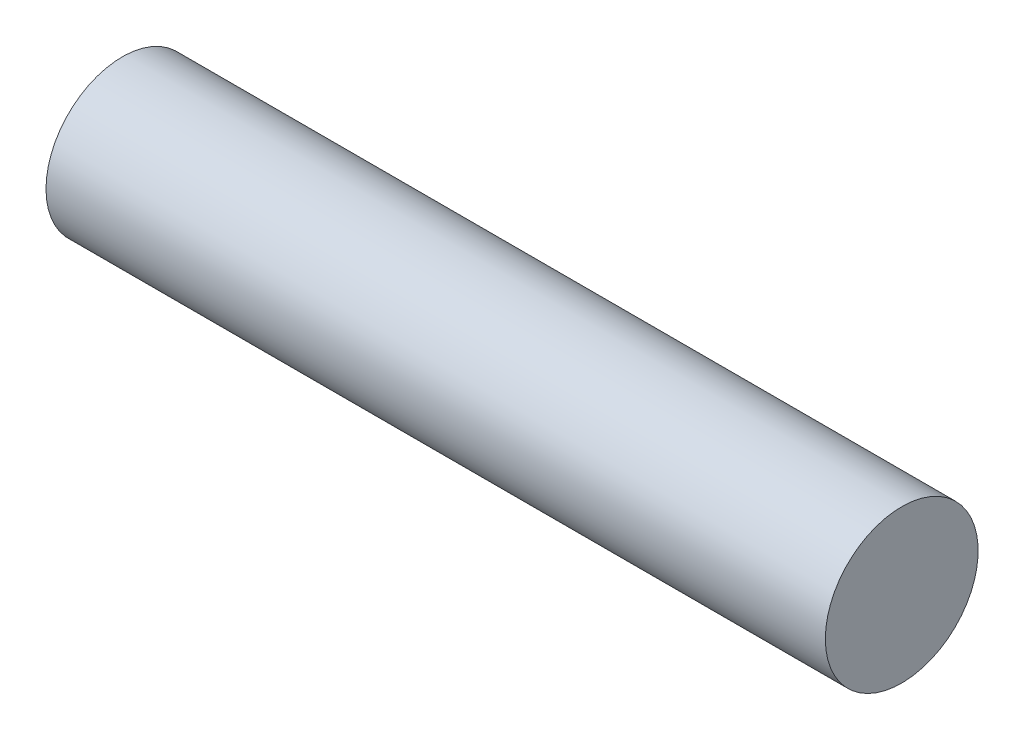
ISO-10303-21;
HEADER;
FILE_DESCRIPTION(('STEP AP214'),'2;1');
FILE_NAME('part.step','',(''),(''),'','','');
FILE_SCHEMA(('AUTOMOTIVE_DESIGN { 1 0 10303 214 1 1 1 1 }'));
ENDSEC;
DATA;
#1=APPLICATION_CONTEXT('core data for automotive mechanical design processes');
#2=APPLICATION_PROTOCOL_DEFINITION('international standard','automotive_design',2000,#1);
#3=PRODUCT_CONTEXT('',#1,'mechanical');
#4=PRODUCT('Part','Part','',(#3));
#5=PRODUCT_RELATED_PRODUCT_CATEGORY('part','',(#4));
#6=PRODUCT_DEFINITION_FORMATION('','',#4);
#7=PRODUCT_DEFINITION_CONTEXT('part definition',#1,'design');
#8=PRODUCT_DEFINITION('design','',#6,#7);
#9=PRODUCT_DEFINITION_SHAPE('','',#8);
#10=(LENGTH_UNIT() NAMED_UNIT(*) SI_UNIT(.MILLI.,.METRE.));
#11=(NAMED_UNIT(*) PLANE_ANGLE_UNIT() SI_UNIT($,.RADIAN.));
#12=(NAMED_UNIT(*) SI_UNIT($,.STERADIAN.) SOLID_ANGLE_UNIT());
#13=UNCERTAINTY_MEASURE_WITH_UNIT(LENGTH_MEASURE(1.E-05),#10,'distance_accuracy_value','');
#14=(GEOMETRIC_REPRESENTATION_CONTEXT(3) GLOBAL_UNCERTAINTY_ASSIGNED_CONTEXT((#13)) GLOBAL_UNIT_ASSIGNED_CONTEXT((#10,
#11,#12)) REPRESENTATION_CONTEXT('',''));
#15=CARTESIAN_POINT('',(0.,0.,0.));
#16=DIRECTION('',(0.,0.,1.));
#17=DIRECTION('',(1.,0.,0.));
#18=AXIS2_PLACEMENT_3D('',#15,#16,#17);
#19=CARTESIAN_POINT('',(0.,0.,0.));
#20=DIRECTION('',(1.,0.,0.));
#21=DIRECTION('',(0.,0.,-1.));
#22=AXIS2_PLACEMENT_3D('',#19,#20,#21);
#23=PLANE('',#22);
#24=CARTESIAN_POINT('',(0.,0.,0.));
#25=DIRECTION('',(-1.,0.,0.));
#26=DIRECTION('',(0.,0.,1.));
#27=AXIS2_PLACEMENT_3D('',#24,#25,#26);
#28=CIRCLE('',#27,75.);
#29=CARTESIAN_POINT('',(0.,0.,75.));
#30=VERTEX_POINT('',#29);
#31=EDGE_CURVE('E10',#30,#30,#28,.T.);
#32=ORIENTED_EDGE('',*,*,#31,.T.);
#33=EDGE_LOOP('',(#32));
#34=FACE_BOUND('',#33,.T.);
#35=ADVANCED_FACE('F31',(#34),#23,.F.);
#36=CARTESIAN_POINT('',(0.,0.,0.));
#37=DIRECTION('',(-1.,0.,0.));
#38=DIRECTION('',(0.,0.,1.));
#39=AXIS2_PLACEMENT_3D('',#36,#37,#38);
#40=CYLINDRICAL_SURFACE('',#39,75.);
#41=ORIENTED_EDGE('',*,*,#31,.F.);
#42=EDGE_LOOP('',(#41));
#43=FACE_BOUND('',#42,.T.);
#44=CARTESIAN_POINT('',(765.,0.,0.));
#45=DIRECTION('',(-1.,0.,0.));
#46=DIRECTION('',(0.,0.,1.));
#47=AXIS2_PLACEMENT_3D('',#44,#45,#46);
#48=CIRCLE('',#47,75.);
#49=CARTESIAN_POINT('',(765.,0.,75.));
#50=VERTEX_POINT('',#49);
#51=EDGE_CURVE('E37',#50,#50,#48,.T.);
#52=ORIENTED_EDGE('',*,*,#51,.T.);
#53=EDGE_LOOP('',(#52));
#54=FACE_BOUND('',#53,.T.);
#55=ADVANCED_FACE('F43',(#43,#54),#40,.T.);
#56=CARTESIAN_POINT('',(765.,0.,0.));
#57=DIRECTION('',(-1.,0.,0.));
#58=DIRECTION('',(0.,0.,1.));
#59=AXIS2_PLACEMENT_3D('',#56,#57,#58);
#60=PLANE('',#59);
#61=ORIENTED_EDGE('',*,*,#51,.F.);
#62=EDGE_LOOP('',(#61));
#63=FACE_BOUND('',#62,.T.);
#64=ADVANCED_FACE('F45',(#63),#60,.F.);
#65=CLOSED_SHELL('',(#35,#55,#64));
#66=MANIFOLD_SOLID_BREP('B2',#65);
#67=ADVANCED_BREP_SHAPE_REPRESENTATION('',(#18,#66),#14);
#68=SHAPE_DEFINITION_REPRESENTATION(#9,#67);
ENDSEC;
END-ISO-10303-21;
